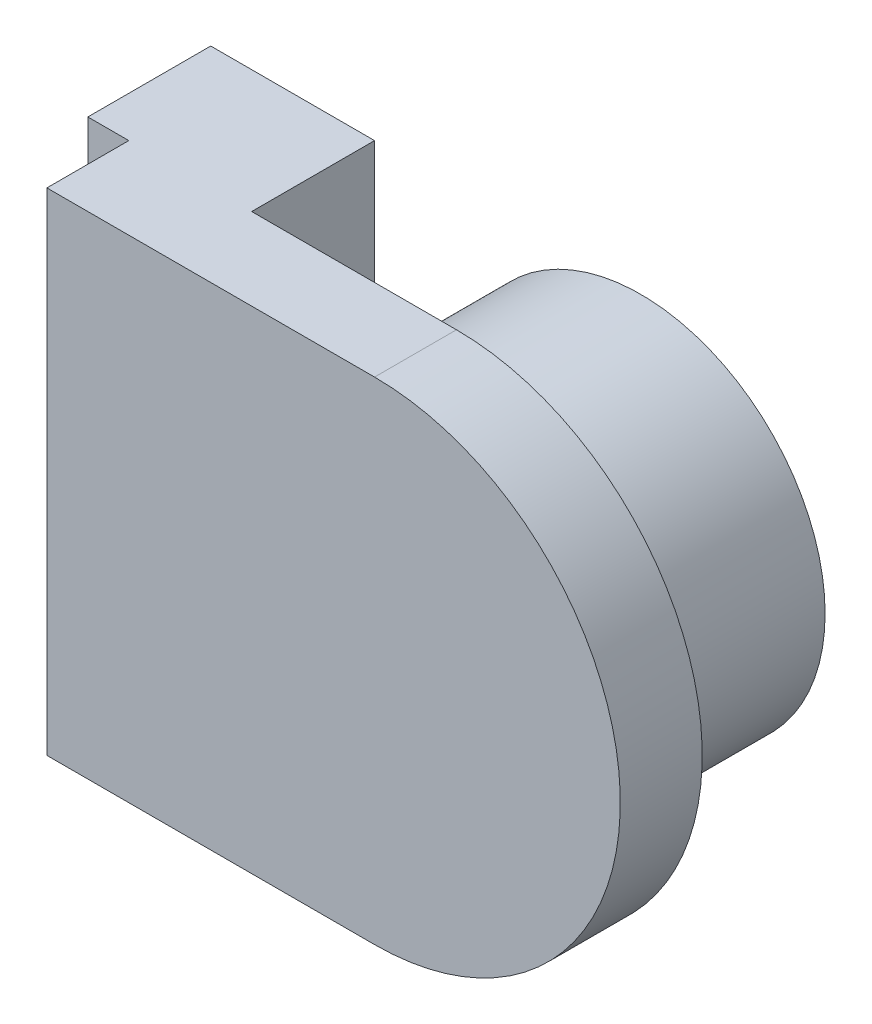
ISO-10303-21;
HEADER;
FILE_DESCRIPTION(('STEP AP214'),'2;1');
FILE_NAME('part.step','',(''),(''),'','','');
FILE_SCHEMA(('AUTOMOTIVE_DESIGN { 1 0 10303 214 1 1 1 1 }'));
ENDSEC;
DATA;
#1=APPLICATION_CONTEXT('core data for automotive mechanical design processes');
#2=APPLICATION_PROTOCOL_DEFINITION('international standard','automotive_design',2000,#1);
#3=PRODUCT_CONTEXT('',#1,'mechanical');
#4=PRODUCT('Part','Part','',(#3));
#5=PRODUCT_RELATED_PRODUCT_CATEGORY('part','',(#4));
#6=PRODUCT_DEFINITION_FORMATION('','',#4);
#7=PRODUCT_DEFINITION_CONTEXT('part definition',#1,'design');
#8=PRODUCT_DEFINITION('design','',#6,#7);
#9=PRODUCT_DEFINITION_SHAPE('','',#8);
#10=(LENGTH_UNIT() NAMED_UNIT(*) SI_UNIT(.MILLI.,.METRE.));
#11=(NAMED_UNIT(*) PLANE_ANGLE_UNIT() SI_UNIT($,.RADIAN.));
#12=(NAMED_UNIT(*) SI_UNIT($,.STERADIAN.) SOLID_ANGLE_UNIT());
#13=UNCERTAINTY_MEASURE_WITH_UNIT(LENGTH_MEASURE(1.E-05),#10,'distance_accuracy_value','');
#14=(GEOMETRIC_REPRESENTATION_CONTEXT(3) GLOBAL_UNCERTAINTY_ASSIGNED_CONTEXT((#13)) GLOBAL_UNIT_ASSIGNED_CONTEXT((#10,
#11,#12)) REPRESENTATION_CONTEXT('',''));
#15=CARTESIAN_POINT('',(0.,0.,0.));
#16=DIRECTION('',(0.,0.,1.));
#17=DIRECTION('',(1.,0.,0.));
#18=AXIS2_PLACEMENT_3D('',#15,#16,#17);
#19=CARTESIAN_POINT('',(0.,0.,0.));
#20=DIRECTION('',(0.,0.,1.));
#21=DIRECTION('',(1.,0.,0.));
#22=AXIS2_PLACEMENT_3D('',#19,#20,#21);
#23=PLANE('',#22);
#24=CARTESIAN_POINT('',(0.,6.,0.));
#25=DIRECTION('',(0.,0.,1.));
#26=DIRECTION('',(1.,0.,0.));
#27=AXIS2_PLACEMENT_3D('',#24,#25,#26);
#28=CIRCLE('',#27,4.5);
#29=CARTESIAN_POINT('',(4.5,6.,0.));
#30=VERTEX_POINT('',#29);
#31=EDGE_CURVE('E126',#30,#30,#28,.T.);
#32=ORIENTED_EDGE('',*,*,#31,.T.);
#33=EDGE_LOOP('',(#32));
#34=FACE_BOUND('',#33,.T.);
#35=DIRECTION('',(0.,-1.,0.));
#36=VECTOR('',#35,1.);
#37=CARTESIAN_POINT('',(-5.,0.,0.));
#38=LINE('',#37,#36);
#39=CARTESIAN_POINT('',(-5.,12.,0.));
#40=VERTEX_POINT('',#39);
#41=CARTESIAN_POINT('',(-5.,0.,0.));
#42=VERTEX_POINT('',#41);
#43=EDGE_CURVE('E66',#40,#42,#38,.T.);
#44=ORIENTED_EDGE('',*,*,#43,.F.);
#45=DIRECTION('',(-1.,0.,0.));
#46=VECTOR('',#45,1.);
#47=CARTESIAN_POINT('',(0.,12.,0.));
#48=LINE('',#47,#46);
#49=CARTESIAN_POINT('',(0.,12.,0.));
#50=VERTEX_POINT('',#49);
#51=EDGE_CURVE('E179',#50,#40,#48,.T.);
#52=ORIENTED_EDGE('',*,*,#51,.F.);
#53=CARTESIAN_POINT('',(0.,6.,0.));
#54=DIRECTION('',(0.,0.,1.));
#55=DIRECTION('',(1.,0.,0.));
#56=AXIS2_PLACEMENT_3D('',#53,#54,#55);
#57=CIRCLE('',#56,6.);
#58=CARTESIAN_POINT('',(0.,0.,0.));
#59=VERTEX_POINT('',#58);
#60=EDGE_CURVE('E165',#50,#59,#57,.F.);
#61=ORIENTED_EDGE('',*,*,#60,.T.);
#62=DIRECTION('',(-1.,0.,0.));
#63=VECTOR('',#62,1.);
#64=CARTESIAN_POINT('',(0.,0.,0.));
#65=LINE('',#64,#63);
#66=EDGE_CURVE('E71',#59,#42,#65,.T.);
#67=ORIENTED_EDGE('',*,*,#66,.T.);
#68=EDGE_LOOP('',(#44,#52,#61,#67));
#69=FACE_BOUND('',#68,.T.);
#70=ADVANCED_FACE('F50',(#34,#69),#23,.F.);
#71=CARTESIAN_POINT('',(0.,12.,2.));
#72=DIRECTION('',(0.,-1.,0.));
#73=DIRECTION('',(1.,0.,0.));
#74=AXIS2_PLACEMENT_3D('',#71,#72,#73);
#75=PLANE('',#74);
#76=ORIENTED_EDGE('',*,*,#51,.T.);
#77=DIRECTION('',(0.,0.,1.));
#78=VECTOR('',#77,1.);
#79=CARTESIAN_POINT('',(-5.,12.,-3.));
#80=LINE('',#79,#78);
#81=CARTESIAN_POINT('',(-5.,12.,-3.));
#82=VERTEX_POINT('',#81);
#83=EDGE_CURVE('E127',#82,#40,#80,.T.);
#84=ORIENTED_EDGE('',*,*,#83,.F.);
#85=DIRECTION('',(-1.,0.,0.));
#86=VECTOR('',#85,1.);
#87=CARTESIAN_POINT('',(0.,12.,-3.));
#88=LINE('',#87,#86);
#89=CARTESIAN_POINT('',(-9.,12.,-3.));
#90=VERTEX_POINT('',#89);
#91=EDGE_CURVE('E132',#82,#90,#88,.T.);
#92=ORIENTED_EDGE('',*,*,#91,.T.);
#93=DIRECTION('',(0.,0.,1.));
#94=VECTOR('',#93,1.);
#95=CARTESIAN_POINT('',(-9.,12.,-3.));
#96=LINE('',#95,#94);
#97=CARTESIAN_POINT('',(-9.,12.,0.));
#98=VERTEX_POINT('',#97);
#99=EDGE_CURVE('E116',#90,#98,#96,.T.);
#100=ORIENTED_EDGE('',*,*,#99,.T.);
#101=DIRECTION('',(-1.,0.,0.));
#102=VECTOR('',#101,1.);
#103=CARTESIAN_POINT('',(0.,12.,0.));
#104=LINE('',#103,#102);
#105=CARTESIAN_POINT('',(-8.,12.,0.));
#106=VERTEX_POINT('',#105);
#107=EDGE_CURVE('E148',#106,#98,#104,.T.);
#108=ORIENTED_EDGE('',*,*,#107,.F.);
#109=DIRECTION('',(0.,0.,-1.));
#110=VECTOR('',#109,1.);
#111=CARTESIAN_POINT('',(-8.,12.,2.));
#112=LINE('',#111,#110);
#113=CARTESIAN_POINT('',(-8.,12.,2.));
#114=VERTEX_POINT('',#113);
#115=EDGE_CURVE('E59',#114,#106,#112,.T.);
#116=ORIENTED_EDGE('',*,*,#115,.F.);
#117=DIRECTION('',(-1.,0.,0.));
#118=VECTOR('',#117,1.);
#119=CARTESIAN_POINT('',(0.,12.,2.));
#120=LINE('',#119,#118);
#121=CARTESIAN_POINT('',(0.,12.,2.));
#122=VERTEX_POINT('',#121);
#123=EDGE_CURVE('E169',#122,#114,#120,.T.);
#124=ORIENTED_EDGE('',*,*,#123,.F.);
#125=DIRECTION('',(0.,0.,-1.));
#126=VECTOR('',#125,1.);
#127=CARTESIAN_POINT('',(0.,12.,2.));
#128=LINE('',#127,#126);
#129=EDGE_CURVE('E12',#122,#50,#128,.T.);
#130=ORIENTED_EDGE('',*,*,#129,.T.);
#131=EDGE_LOOP('',(#76,#84,#92,#100,#108,#116,#124,#130));
#132=FACE_BOUND('',#131,.T.);
#133=ADVANCED_FACE('F138',(#132),#75,.F.);
#134=CARTESIAN_POINT('',(-8.,0.,2.));
#135=DIRECTION('',(-1.,0.,0.));
#136=DIRECTION('',(0.,-1.,0.));
#137=AXIS2_PLACEMENT_3D('',#134,#135,#136);
#138=PLANE('',#137);
#139=DIRECTION('',(0.,1.,0.));
#140=VECTOR('',#139,1.);
#141=CARTESIAN_POINT('',(-8.,0.,0.));
#142=LINE('',#141,#140);
#143=CARTESIAN_POINT('',(-8.,0.,0.));
#144=VERTEX_POINT('',#143);
#145=EDGE_CURVE('E181',#144,#106,#142,.T.);
#146=ORIENTED_EDGE('',*,*,#145,.F.);
#147=DIRECTION('',(0.,0.,-1.));
#148=VECTOR('',#147,1.);
#149=CARTESIAN_POINT('',(-8.,0.,2.));
#150=LINE('',#149,#148);
#151=CARTESIAN_POINT('',(-8.,0.,2.));
#152=VERTEX_POINT('',#151);
#153=EDGE_CURVE('E186',#152,#144,#150,.T.);
#154=ORIENTED_EDGE('',*,*,#153,.F.);
#155=DIRECTION('',(0.,1.,0.));
#156=VECTOR('',#155,1.);
#157=CARTESIAN_POINT('',(-8.,0.,2.));
#158=LINE('',#157,#156);
#159=EDGE_CURVE('E171',#152,#114,#158,.T.);
#160=ORIENTED_EDGE('',*,*,#159,.T.);
#161=ORIENTED_EDGE('',*,*,#115,.T.);
#162=EDGE_LOOP('',(#146,#154,#160,#161));
#163=FACE_BOUND('',#162,.T.);
#164=ADVANCED_FACE('F191',(#163),#138,.T.);
#165=CARTESIAN_POINT('',(0.,0.,2.));
#166=DIRECTION('',(0.,-1.,0.));
#167=DIRECTION('',(0.,0.,-1.));
#168=AXIS2_PLACEMENT_3D('',#165,#166,#167);
#169=PLANE('',#168);
#170=ORIENTED_EDGE('',*,*,#66,.F.);
#171=DIRECTION('',(0.,0.,-1.));
#172=VECTOR('',#171,1.);
#173=CARTESIAN_POINT('',(0.,0.,2.));
#174=LINE('',#173,#172);
#175=CARTESIAN_POINT('',(0.,0.,2.));
#176=VERTEX_POINT('',#175);
#177=EDGE_CURVE('E177',#176,#59,#174,.T.);
#178=ORIENTED_EDGE('',*,*,#177,.F.);
#179=DIRECTION('',(-1.,0.,0.));
#180=VECTOR('',#179,1.);
#181=CARTESIAN_POINT('',(0.,0.,2.));
#182=LINE('',#181,#180);
#183=EDGE_CURVE('E174',#176,#152,#182,.T.);
#184=ORIENTED_EDGE('',*,*,#183,.T.);
#185=ORIENTED_EDGE('',*,*,#153,.T.);
#186=DIRECTION('',(-1.,0.,0.));
#187=VECTOR('',#186,1.);
#188=CARTESIAN_POINT('',(0.,0.,0.));
#189=LINE('',#188,#187);
#190=CARTESIAN_POINT('',(-9.,0.,0.));
#191=VERTEX_POINT('',#190);
#192=EDGE_CURVE('E136',#144,#191,#189,.T.);
#193=ORIENTED_EDGE('',*,*,#192,.T.);
#194=DIRECTION('',(0.,0.,1.));
#195=VECTOR('',#194,1.);
#196=CARTESIAN_POINT('',(-9.,0.,-3.));
#197=LINE('',#196,#195);
#198=CARTESIAN_POINT('',(-9.,0.,-3.));
#199=VERTEX_POINT('',#198);
#200=EDGE_CURVE('E146',#199,#191,#197,.T.);
#201=ORIENTED_EDGE('',*,*,#200,.F.);
#202=DIRECTION('',(-1.,0.,0.));
#203=VECTOR('',#202,1.);
#204=CARTESIAN_POINT('',(0.,0.,-3.));
#205=LINE('',#204,#203);
#206=CARTESIAN_POINT('',(-5.,0.,-3.));
#207=VERTEX_POINT('',#206);
#208=EDGE_CURVE('E134',#207,#199,#205,.T.);
#209=ORIENTED_EDGE('',*,*,#208,.F.);
#210=DIRECTION('',(0.,0.,1.));
#211=VECTOR('',#210,1.);
#212=CARTESIAN_POINT('',(-5.,0.,-3.));
#213=LINE('',#212,#211);
#214=EDGE_CURVE('E153',#207,#42,#213,.T.);
#215=ORIENTED_EDGE('',*,*,#214,.T.);
#216=EDGE_LOOP('',(#170,#178,#184,#185,#193,#201,#209,#215));
#217=FACE_BOUND('',#216,.T.);
#218=ADVANCED_FACE('F198',(#217),#169,.T.);
#219=CARTESIAN_POINT('',(0.,6.,2.));
#220=DIRECTION('',(0.,0.,-1.));
#221=DIRECTION('',(-1.,0.,0.));
#222=AXIS2_PLACEMENT_3D('',#219,#220,#221);
#223=CYLINDRICAL_SURFACE('',#222,6.);
#224=ORIENTED_EDGE('',*,*,#60,.F.);
#225=ORIENTED_EDGE('',*,*,#129,.F.);
#226=CARTESIAN_POINT('',(0.,6.,2.));
#227=DIRECTION('',(0.,0.,1.));
#228=DIRECTION('',(1.,0.,0.));
#229=AXIS2_PLACEMENT_3D('',#226,#227,#228);
#230=CIRCLE('',#229,6.);
#231=EDGE_CURVE('E166',#122,#176,#230,.F.);
#232=ORIENTED_EDGE('',*,*,#231,.T.);
#233=ORIENTED_EDGE('',*,*,#177,.T.);
#234=EDGE_LOOP('',(#224,#225,#232,#233));
#235=FACE_BOUND('',#234,.T.);
#236=ADVANCED_FACE('F52',(#235),#223,.T.);
#237=CARTESIAN_POINT('',(0.,0.,2.));
#238=DIRECTION('',(0.,0.,1.));
#239=DIRECTION('',(1.,0.,0.));
#240=AXIS2_PLACEMENT_3D('',#237,#238,#239);
#241=PLANE('',#240);
#242=ORIENTED_EDGE('',*,*,#231,.F.);
#243=ORIENTED_EDGE('',*,*,#123,.T.);
#244=ORIENTED_EDGE('',*,*,#159,.F.);
#245=ORIENTED_EDGE('',*,*,#183,.F.);
#246=EDGE_LOOP('',(#242,#243,#244,#245));
#247=FACE_BOUND('',#246,.T.);
#248=ADVANCED_FACE('F202',(#247),#241,.T.);
#249=CARTESIAN_POINT('',(0.,6.,-4.5));
#250=DIRECTION('',(0.,0.,1.));
#251=DIRECTION('',(1.,0.,0.));
#252=AXIS2_PLACEMENT_3D('',#249,#250,#251);
#253=CYLINDRICAL_SURFACE('',#252,4.5);
#254=CARTESIAN_POINT('',(0.,6.,-4.5));
#255=DIRECTION('',(0.,0.,1.));
#256=DIRECTION('',(1.,0.,0.));
#257=AXIS2_PLACEMENT_3D('',#254,#255,#256);
#258=CIRCLE('',#257,4.5);
#259=CARTESIAN_POINT('',(4.5,6.,-4.5));
#260=VERTEX_POINT('',#259);
#261=EDGE_CURVE('E157',#260,#260,#258,.T.);
#262=ORIENTED_EDGE('',*,*,#261,.T.);
#263=EDGE_LOOP('',(#262));
#264=FACE_BOUND('',#263,.T.);
#265=ORIENTED_EDGE('',*,*,#31,.F.);
#266=EDGE_LOOP('',(#265));
#267=FACE_BOUND('',#266,.T.);
#268=ADVANCED_FACE('F250',(#264,#267),#253,.T.);
#269=CARTESIAN_POINT('',(0.,0.,-4.5));
#270=DIRECTION('',(0.,0.,1.));
#271=DIRECTION('',(1.,0.,0.));
#272=AXIS2_PLACEMENT_3D('',#269,#270,#271);
#273=PLANE('',#272);
#274=CARTESIAN_POINT('',(0.,6.,-4.5));
#275=DIRECTION('',(0.,0.,1.));
#276=DIRECTION('',(1.,0.,0.));
#277=AXIS2_PLACEMENT_3D('',#274,#275,#276);
#278=CIRCLE('',#277,0.5);
#279=CARTESIAN_POINT('',(0.499999999999999,6.,-4.5));
#280=VERTEX_POINT('',#279);
#281=EDGE_CURVE('E54',#280,#280,#278,.F.);
#282=ORIENTED_EDGE('',*,*,#281,.F.);
#283=EDGE_LOOP('',(#282));
#284=FACE_BOUND('',#283,.T.);
#285=ORIENTED_EDGE('',*,*,#261,.F.);
#286=EDGE_LOOP('',(#285));
#287=FACE_BOUND('',#286,.T.);
#288=ADVANCED_FACE('F256',(#284,#287),#273,.F.);
#289=CARTESIAN_POINT('',(0.,0.,-5.));
#290=DIRECTION('',(0.,0.,1.));
#291=DIRECTION('',(1.,0.,0.));
#292=AXIS2_PLACEMENT_3D('',#289,#290,#291);
#293=PLANE('',#292);
#294=CARTESIAN_POINT('',(0.,6.,-5.));
#295=DIRECTION('',(0.,0.,1.));
#296=DIRECTION('',(1.,0.,0.));
#297=AXIS2_PLACEMENT_3D('',#294,#295,#296);
#298=CIRCLE('',#297,0.5);
#299=CARTESIAN_POINT('',(0.499999999999999,6.,-5.));
#300=VERTEX_POINT('',#299);
#301=EDGE_CURVE('E162',#300,#300,#298,.T.);
#302=ORIENTED_EDGE('',*,*,#301,.F.);
#303=EDGE_LOOP('',(#302));
#304=FACE_BOUND('',#303,.T.);
#305=ADVANCED_FACE('F264',(#304),#293,.F.);
#306=CARTESIAN_POINT('',(0.,6.,-5.));
#307=DIRECTION('',(0.,0.,1.));
#308=DIRECTION('',(1.,0.,0.));
#309=AXIS2_PLACEMENT_3D('',#306,#307,#308);
#310=CYLINDRICAL_SURFACE('',#309,0.5);
#311=ORIENTED_EDGE('',*,*,#301,.T.);
#312=EDGE_LOOP('',(#311));
#313=FACE_BOUND('',#312,.T.);
#314=ORIENTED_EDGE('',*,*,#281,.T.);
#315=EDGE_LOOP('',(#314));
#316=FACE_BOUND('',#315,.T.);
#317=ADVANCED_FACE('F215',(#313,#316),#310,.T.);
#318=CARTESIAN_POINT('',(-9.,0.,-3.));
#319=DIRECTION('',(-1.,0.,0.));
#320=DIRECTION('',(0.,-1.,0.));
#321=AXIS2_PLACEMENT_3D('',#318,#319,#320);
#322=PLANE('',#321);
#323=DIRECTION('',(0.,-1.,0.));
#324=VECTOR('',#323,1.);
#325=CARTESIAN_POINT('',(-9.,0.,0.));
#326=LINE('',#325,#324);
#327=EDGE_CURVE('E122',#98,#191,#326,.T.);
#328=ORIENTED_EDGE('',*,*,#327,.F.);
#329=ORIENTED_EDGE('',*,*,#99,.F.);
#330=DIRECTION('',(0.,-1.,0.));
#331=VECTOR('',#330,1.);
#332=CARTESIAN_POINT('',(-9.,0.,-3.));
#333=LINE('',#332,#331);
#334=EDGE_CURVE('E120',#90,#199,#333,.T.);
#335=ORIENTED_EDGE('',*,*,#334,.T.);
#336=ORIENTED_EDGE('',*,*,#200,.T.);
#337=EDGE_LOOP('',(#328,#329,#335,#336));
#338=FACE_BOUND('',#337,.T.);
#339=ADVANCED_FACE('F118',(#338),#322,.T.);
#340=CARTESIAN_POINT('',(-5.,0.,-3.));
#341=DIRECTION('',(-1.,0.,0.));
#342=DIRECTION('',(0.,-1.,0.));
#343=AXIS2_PLACEMENT_3D('',#340,#341,#342);
#344=PLANE('',#343);
#345=ORIENTED_EDGE('',*,*,#43,.T.);
#346=ORIENTED_EDGE('',*,*,#214,.F.);
#347=DIRECTION('',(0.,-1.,0.));
#348=VECTOR('',#347,1.);
#349=CARTESIAN_POINT('',(-5.,0.,-3.));
#350=LINE('',#349,#348);
#351=EDGE_CURVE('E141',#82,#207,#350,.T.);
#352=ORIENTED_EDGE('',*,*,#351,.F.);
#353=ORIENTED_EDGE('',*,*,#83,.T.);
#354=EDGE_LOOP('',(#345,#346,#352,#353));
#355=FACE_BOUND('',#354,.T.);
#356=ADVANCED_FACE('F207',(#355),#344,.F.);
#357=CARTESIAN_POINT('',(0.,0.,-3.));
#358=DIRECTION('',(0.,0.,-1.));
#359=DIRECTION('',(-1.,0.,0.));
#360=AXIS2_PLACEMENT_3D('',#357,#358,#359);
#361=PLANE('',#360);
#362=ORIENTED_EDGE('',*,*,#334,.F.);
#363=ORIENTED_EDGE('',*,*,#91,.F.);
#364=ORIENTED_EDGE('',*,*,#351,.T.);
#365=ORIENTED_EDGE('',*,*,#208,.T.);
#366=EDGE_LOOP('',(#362,#363,#364,#365));
#367=FACE_BOUND('',#366,.T.);
#368=ADVANCED_FACE('F131',(#367),#361,.T.);
#369=CARTESIAN_POINT('',(0.,0.,0.));
#370=DIRECTION('',(0.,0.,-1.));
#371=DIRECTION('',(-1.,0.,0.));
#372=AXIS2_PLACEMENT_3D('',#369,#370,#371);
#373=PLANE('',#372);
#374=ORIENTED_EDGE('',*,*,#145,.T.);
#375=ORIENTED_EDGE('',*,*,#107,.T.);
#376=ORIENTED_EDGE('',*,*,#327,.T.);
#377=ORIENTED_EDGE('',*,*,#192,.F.);
#378=EDGE_LOOP('',(#374,#375,#376,#377));
#379=FACE_BOUND('',#378,.T.);
#380=ADVANCED_FACE('F196',(#379),#373,.F.);
#381=CLOSED_SHELL('',(#70,#133,#164,#218,#236,#248,#268,#288,#305,#317,#339,#356,#368,#380));
#382=MANIFOLD_SOLID_BREP('B2',#381);
#383=ADVANCED_BREP_SHAPE_REPRESENTATION('',(#18,#382),#14);
#384=SHAPE_DEFINITION_REPRESENTATION(#9,#383);
ENDSEC;
END-ISO-10303-21;
